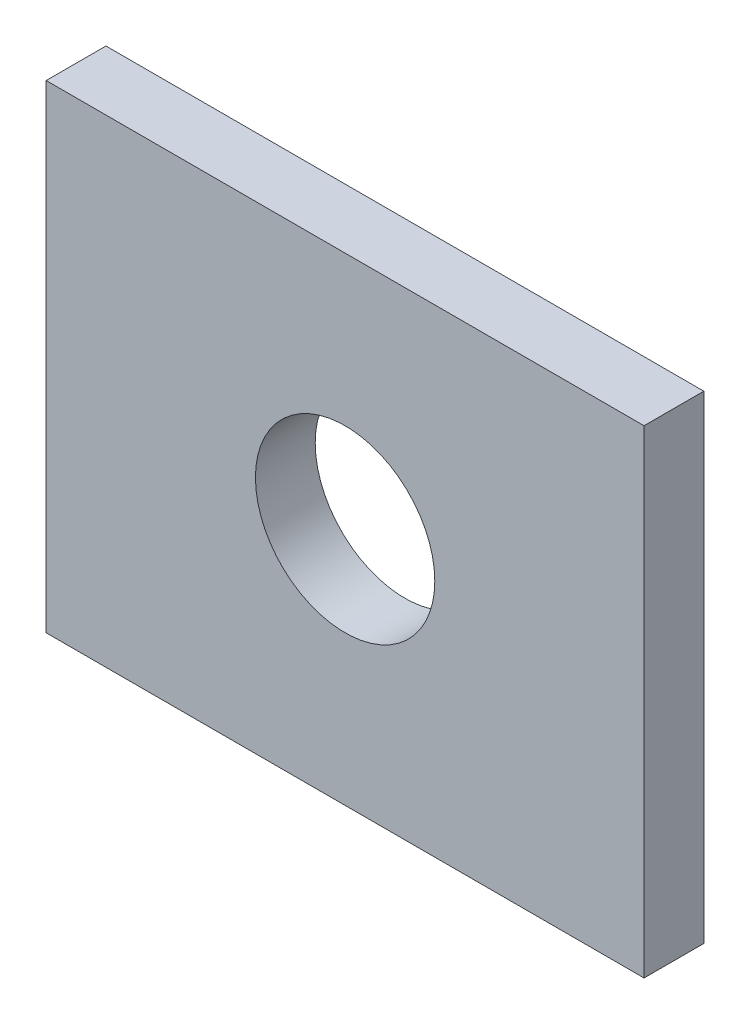
ISO-10303-21;
HEADER;
FILE_DESCRIPTION(('STEP AP214'),'2;1');
FILE_NAME('part.step','',(''),(''),'','','');
FILE_SCHEMA(('AUTOMOTIVE_DESIGN { 1 0 10303 214 1 1 1 1 }'));
ENDSEC;
DATA;
#1=APPLICATION_CONTEXT('core data for automotive mechanical design processes');
#2=APPLICATION_PROTOCOL_DEFINITION('international standard','automotive_design',2000,#1);
#3=PRODUCT_CONTEXT('',#1,'mechanical');
#4=PRODUCT('Part','Part','',(#3));
#5=PRODUCT_RELATED_PRODUCT_CATEGORY('part','',(#4));
#6=PRODUCT_DEFINITION_FORMATION('','',#4);
#7=PRODUCT_DEFINITION_CONTEXT('part definition',#1,'design');
#8=PRODUCT_DEFINITION('design','',#6,#7);
#9=PRODUCT_DEFINITION_SHAPE('','',#8);
#10=(LENGTH_UNIT() NAMED_UNIT(*) SI_UNIT(.MILLI.,.METRE.));
#11=(NAMED_UNIT(*) PLANE_ANGLE_UNIT() SI_UNIT($,.RADIAN.));
#12=(NAMED_UNIT(*) SI_UNIT($,.STERADIAN.) SOLID_ANGLE_UNIT());
#13=UNCERTAINTY_MEASURE_WITH_UNIT(LENGTH_MEASURE(1.E-05),#10,'distance_accuracy_value','');
#14=(GEOMETRIC_REPRESENTATION_CONTEXT(3) GLOBAL_UNCERTAINTY_ASSIGNED_CONTEXT((#13)) GLOBAL_UNIT_ASSIGNED_CONTEXT((#10,
#11,#12)) REPRESENTATION_CONTEXT('',''));
#15=CARTESIAN_POINT('',(0.,0.,0.));
#16=DIRECTION('',(0.,0.,1.));
#17=DIRECTION('',(1.,0.,0.));
#18=AXIS2_PLACEMENT_3D('',#15,#16,#17);
#19=CARTESIAN_POINT('',(0.,0.,0.5));
#20=DIRECTION('',(0.,0.,1.));
#21=DIRECTION('',(1.,0.,0.));
#22=AXIS2_PLACEMENT_3D('',#19,#20,#21);
#23=PLANE('',#22);
#24=DIRECTION('',(0.,-1.,0.));
#25=VECTOR('',#24,1.);
#26=CARTESIAN_POINT('',(-5.,-4.,0.5));
#27=LINE('',#26,#25);
#28=CARTESIAN_POINT('',(-5.,4.,0.5));
#29=VERTEX_POINT('',#28);
#30=CARTESIAN_POINT('',(-5.,-4.,0.5));
#31=VERTEX_POINT('',#30);
#32=EDGE_CURVE('E84',#29,#31,#27,.T.);
#33=ORIENTED_EDGE('',*,*,#32,.T.);
#34=DIRECTION('',(1.,0.,0.));
#35=VECTOR('',#34,1.);
#36=CARTESIAN_POINT('',(5.,-4.,0.5));
#37=LINE('',#36,#35);
#38=CARTESIAN_POINT('',(5.,-4.,0.5));
#39=VERTEX_POINT('',#38);
#40=EDGE_CURVE('E79',#31,#39,#37,.T.);
#41=ORIENTED_EDGE('',*,*,#40,.T.);
#42=DIRECTION('',(0.,1.,0.));
#43=VECTOR('',#42,1.);
#44=CARTESIAN_POINT('',(5.,-4.,0.5));
#45=LINE('',#44,#43);
#46=CARTESIAN_POINT('',(5.,4.,0.5));
#47=VERTEX_POINT('',#46);
#48=EDGE_CURVE('E82',#39,#47,#45,.T.);
#49=ORIENTED_EDGE('',*,*,#48,.T.);
#50=DIRECTION('',(-1.,0.,0.));
#51=VECTOR('',#50,1.);
#52=CARTESIAN_POINT('',(5.,4.,0.5));
#53=LINE('',#52,#51);
#54=EDGE_CURVE('E49',#47,#29,#53,.T.);
#55=ORIENTED_EDGE('',*,*,#54,.T.);
#56=EDGE_LOOP('',(#33,#41,#49,#55));
#57=FACE_BOUND('',#56,.T.);
#58=CARTESIAN_POINT('',(0.,0.,0.5));
#59=DIRECTION('',(0.,0.,1.));
#60=DIRECTION('',(1.,0.,0.));
#61=AXIS2_PLACEMENT_3D('',#58,#59,#60);
#62=CIRCLE('',#61,1.5);
#63=CARTESIAN_POINT('',(1.5,0.,0.5));
#64=VERTEX_POINT('',#63);
#65=EDGE_CURVE('E99',#64,#64,#62,.T.);
#66=ORIENTED_EDGE('',*,*,#65,.F.);
#67=EDGE_LOOP('',(#66));
#68=FACE_BOUND('',#67,.T.);
#69=ADVANCED_FACE('F32',(#57,#68),#23,.T.);
#70=CARTESIAN_POINT('',(0.,0.,-0.5));
#71=DIRECTION('',(0.,0.,1.));
#72=DIRECTION('',(1.,0.,0.));
#73=AXIS2_PLACEMENT_3D('',#70,#71,#72);
#74=PLANE('',#73);
#75=DIRECTION('',(0.,-1.,0.));
#76=VECTOR('',#75,1.);
#77=CARTESIAN_POINT('',(-5.,-4.,-0.5));
#78=LINE('',#77,#76);
#79=CARTESIAN_POINT('',(-5.,4.,-0.5));
#80=VERTEX_POINT('',#79);
#81=CARTESIAN_POINT('',(-5.,-4.,-0.5));
#82=VERTEX_POINT('',#81);
#83=EDGE_CURVE('E96',#80,#82,#78,.T.);
#84=ORIENTED_EDGE('',*,*,#83,.F.);
#85=DIRECTION('',(-1.,0.,0.));
#86=VECTOR('',#85,1.);
#87=CARTESIAN_POINT('',(5.,4.,-0.5));
#88=LINE('',#87,#86);
#89=CARTESIAN_POINT('',(5.,4.,-0.5));
#90=VERTEX_POINT('',#89);
#91=EDGE_CURVE('E72',#90,#80,#88,.T.);
#92=ORIENTED_EDGE('',*,*,#91,.F.);
#93=DIRECTION('',(0.,1.,0.));
#94=VECTOR('',#93,1.);
#95=CARTESIAN_POINT('',(5.,-4.,-0.5));
#96=LINE('',#95,#94);
#97=CARTESIAN_POINT('',(5.,-4.,-0.5));
#98=VERTEX_POINT('',#97);
#99=EDGE_CURVE('E66',#98,#90,#96,.T.);
#100=ORIENTED_EDGE('',*,*,#99,.F.);
#101=DIRECTION('',(1.,0.,0.));
#102=VECTOR('',#101,1.);
#103=CARTESIAN_POINT('',(5.,-4.,-0.5));
#104=LINE('',#103,#102);
#105=EDGE_CURVE('E88',#82,#98,#104,.T.);
#106=ORIENTED_EDGE('',*,*,#105,.F.);
#107=EDGE_LOOP('',(#84,#92,#100,#106));
#108=FACE_BOUND('',#107,.T.);
#109=CARTESIAN_POINT('',(0.,0.,-0.5));
#110=DIRECTION('',(0.,0.,1.));
#111=DIRECTION('',(1.,0.,0.));
#112=AXIS2_PLACEMENT_3D('',#109,#110,#111);
#113=CIRCLE('',#112,1.5);
#114=CARTESIAN_POINT('',(1.5,0.,-0.5));
#115=VERTEX_POINT('',#114);
#116=EDGE_CURVE('E111',#115,#115,#113,.T.);
#117=ORIENTED_EDGE('',*,*,#116,.T.);
#118=EDGE_LOOP('',(#117));
#119=FACE_BOUND('',#118,.T.);
#120=ADVANCED_FACE('F107',(#108,#119),#74,.F.);
#121=CARTESIAN_POINT('',(-5.,-4.,0.5));
#122=DIRECTION('',(1.,0.,0.));
#123=DIRECTION('',(0.,0.,-1.));
#124=AXIS2_PLACEMENT_3D('',#121,#122,#123);
#125=PLANE('',#124);
#126=ORIENTED_EDGE('',*,*,#83,.T.);
#127=DIRECTION('',(0.,0.,-1.));
#128=VECTOR('',#127,1.);
#129=CARTESIAN_POINT('',(-5.,-4.,0.5));
#130=LINE('',#129,#128);
#131=EDGE_CURVE('E11',#31,#82,#130,.T.);
#132=ORIENTED_EDGE('',*,*,#131,.F.);
#133=ORIENTED_EDGE('',*,*,#32,.F.);
#134=DIRECTION('',(0.,0.,-1.));
#135=VECTOR('',#134,1.);
#136=CARTESIAN_POINT('',(-5.,4.,0.5));
#137=LINE('',#136,#135);
#138=EDGE_CURVE('E92',#29,#80,#137,.T.);
#139=ORIENTED_EDGE('',*,*,#138,.T.);
#140=EDGE_LOOP('',(#126,#132,#133,#139));
#141=FACE_BOUND('',#140,.T.);
#142=ADVANCED_FACE('F34',(#141),#125,.F.);
#143=CARTESIAN_POINT('',(5.,-4.,0.5));
#144=DIRECTION('',(0.,1.,0.));
#145=DIRECTION('',(-1.,0.,0.));
#146=AXIS2_PLACEMENT_3D('',#143,#144,#145);
#147=PLANE('',#146);
#148=ORIENTED_EDGE('',*,*,#105,.T.);
#149=DIRECTION('',(0.,0.,-1.));
#150=VECTOR('',#149,1.);
#151=CARTESIAN_POINT('',(5.,-4.,0.5));
#152=LINE('',#151,#150);
#153=EDGE_CURVE('E41',#39,#98,#152,.T.);
#154=ORIENTED_EDGE('',*,*,#153,.F.);
#155=ORIENTED_EDGE('',*,*,#40,.F.);
#156=ORIENTED_EDGE('',*,*,#131,.T.);
#157=EDGE_LOOP('',(#148,#154,#155,#156));
#158=FACE_BOUND('',#157,.T.);
#159=ADVANCED_FACE('F87',(#158),#147,.F.);
#160=CARTESIAN_POINT('',(5.,-4.,0.5));
#161=DIRECTION('',(-1.,0.,0.));
#162=DIRECTION('',(0.,0.,1.));
#163=AXIS2_PLACEMENT_3D('',#160,#161,#162);
#164=PLANE('',#163);
#165=ORIENTED_EDGE('',*,*,#99,.T.);
#166=DIRECTION('',(0.,0.,-1.));
#167=VECTOR('',#166,1.);
#168=CARTESIAN_POINT('',(5.,4.,0.5));
#169=LINE('',#168,#167);
#170=EDGE_CURVE('E89',#47,#90,#169,.T.);
#171=ORIENTED_EDGE('',*,*,#170,.F.);
#172=ORIENTED_EDGE('',*,*,#48,.F.);
#173=ORIENTED_EDGE('',*,*,#153,.T.);
#174=EDGE_LOOP('',(#165,#171,#172,#173));
#175=FACE_BOUND('',#174,.T.);
#176=ADVANCED_FACE('F90',(#175),#164,.F.);
#177=CARTESIAN_POINT('',(5.,4.,0.5));
#178=DIRECTION('',(0.,-1.,0.));
#179=DIRECTION('',(1.,0.,0.));
#180=AXIS2_PLACEMENT_3D('',#177,#178,#179);
#181=PLANE('',#180);
#182=ORIENTED_EDGE('',*,*,#91,.T.);
#183=ORIENTED_EDGE('',*,*,#138,.F.);
#184=ORIENTED_EDGE('',*,*,#54,.F.);
#185=ORIENTED_EDGE('',*,*,#170,.T.);
#186=EDGE_LOOP('',(#182,#183,#184,#185));
#187=FACE_BOUND('',#186,.T.);
#188=ADVANCED_FACE('F104',(#187),#181,.F.);
#189=CARTESIAN_POINT('',(0.,0.,0.5));
#190=DIRECTION('',(0.,0.,-1.));
#191=DIRECTION('',(-1.,0.,0.));
#192=AXIS2_PLACEMENT_3D('',#189,#190,#191);
#193=CYLINDRICAL_SURFACE('',#192,1.5);
#194=ORIENTED_EDGE('',*,*,#65,.T.);
#195=EDGE_LOOP('',(#194));
#196=FACE_BOUND('',#195,.T.);
#197=ORIENTED_EDGE('',*,*,#116,.F.);
#198=EDGE_LOOP('',(#197));
#199=FACE_BOUND('',#198,.T.);
#200=ADVANCED_FACE('F117',(#196,#199),#193,.F.);
#201=CLOSED_SHELL('',(#69,#120,#142,#159,#176,#188,#200));
#202=MANIFOLD_SOLID_BREP('B2',#201);
#203=ADVANCED_BREP_SHAPE_REPRESENTATION('',(#18,#202),#14);
#204=SHAPE_DEFINITION_REPRESENTATION(#9,#203);
ENDSEC;
END-ISO-10303-21;
